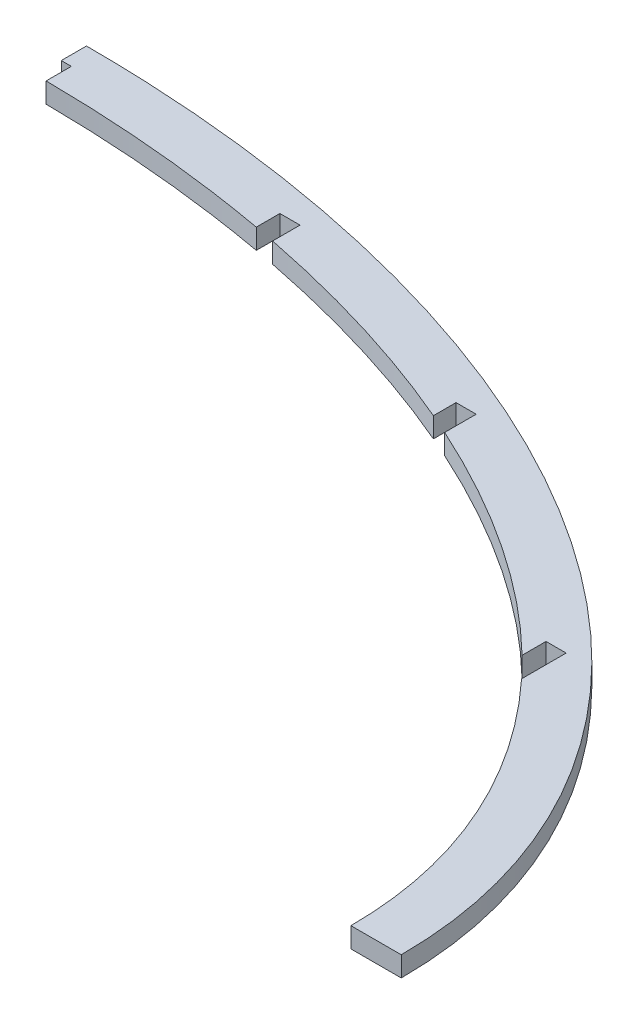
ISO-10303-21;
HEADER;
FILE_DESCRIPTION(('STEP AP214'),'2;1');
FILE_NAME('part.step','',(''),(''),'','','');
FILE_SCHEMA(('AUTOMOTIVE_DESIGN { 1 0 10303 214 1 1 1 1 }'));
ENDSEC;
DATA;
#1=APPLICATION_CONTEXT('core data for automotive mechanical design processes');
#2=APPLICATION_PROTOCOL_DEFINITION('international standard','automotive_design',2000,#1);
#3=PRODUCT_CONTEXT('',#1,'mechanical');
#4=PRODUCT('Part','Part','',(#3));
#5=PRODUCT_RELATED_PRODUCT_CATEGORY('part','',(#4));
#6=PRODUCT_DEFINITION_FORMATION('','',#4);
#7=PRODUCT_DEFINITION_CONTEXT('part definition',#1,'design');
#8=PRODUCT_DEFINITION('design','',#6,#7);
#9=PRODUCT_DEFINITION_SHAPE('','',#8);
#10=(LENGTH_UNIT() NAMED_UNIT(*) SI_UNIT(.MILLI.,.METRE.));
#11=(NAMED_UNIT(*) PLANE_ANGLE_UNIT() SI_UNIT($,.RADIAN.));
#12=(NAMED_UNIT(*) SI_UNIT($,.STERADIAN.) SOLID_ANGLE_UNIT());
#13=UNCERTAINTY_MEASURE_WITH_UNIT(LENGTH_MEASURE(1.E-05),#10,'distance_accuracy_value','');
#14=(GEOMETRIC_REPRESENTATION_CONTEXT(3) GLOBAL_UNCERTAINTY_ASSIGNED_CONTEXT((#13)) GLOBAL_UNIT_ASSIGNED_CONTEXT((#10,
#11,#12)) REPRESENTATION_CONTEXT('',''));
#15=CARTESIAN_POINT('',(0.,0.,0.));
#16=DIRECTION('',(0.,0.,1.));
#17=DIRECTION('',(1.,0.,0.));
#18=AXIS2_PLACEMENT_3D('',#15,#16,#17);
#19=CARTESIAN_POINT('',(-808.,16.,-461.62));
#20=DIRECTION('',(-1.,0.,0.));
#21=DIRECTION('',(0.,0.,1.));
#22=AXIS2_PLACEMENT_3D('',#19,#20,#21);
#23=PLANE('',#22);
#24=DIRECTION('',(0.,0.,-1.));
#25=VECTOR('',#24,1.);
#26=CARTESIAN_POINT('',(-808.,0.,-461.62));
#27=LINE('',#26,#25);
#28=CARTESIAN_POINT('',(-808.,0.,-442.861199088835));
#29=VERTEX_POINT('',#28);
#30=CARTESIAN_POINT('',(-808.,0.,-461.62));
#31=VERTEX_POINT('',#30);
#32=EDGE_CURVE('E198',#29,#31,#27,.T.);
#33=ORIENTED_EDGE('',*,*,#32,.T.);
#34=DIRECTION('',(0.,-1.,0.));
#35=VECTOR('',#34,1.);
#36=CARTESIAN_POINT('',(-808.,16.,-461.62));
#37=LINE('',#36,#35);
#38=CARTESIAN_POINT('',(-808.,16.,-461.62));
#39=VERTEX_POINT('',#38);
#40=EDGE_CURVE('E11',#39,#31,#37,.T.);
#41=ORIENTED_EDGE('',*,*,#40,.F.);
#42=DIRECTION('',(0.,0.,-1.));
#43=VECTOR('',#42,1.);
#44=CARTESIAN_POINT('',(-808.,16.,-461.62));
#45=LINE('',#44,#43);
#46=CARTESIAN_POINT('',(-808.,16.,-442.861199088835));
#47=VERTEX_POINT('',#46);
#48=EDGE_CURVE('E359',#47,#39,#45,.T.);
#49=ORIENTED_EDGE('',*,*,#48,.F.);
#50=DIRECTION('',(0.,-1.,0.));
#51=VECTOR('',#50,1.);
#52=CARTESIAN_POINT('',(-808.,16.,-442.861199088835));
#53=LINE('',#52,#51);
#54=EDGE_CURVE('E193',#47,#29,#53,.T.);
#55=ORIENTED_EDGE('',*,*,#54,.T.);
#56=EDGE_LOOP('',(#33,#41,#49,#55));
#57=FACE_BOUND('',#56,.T.);
#58=ADVANCED_FACE('F41',(#57),#23,.F.);
#59=CARTESIAN_POINT('',(-808.,16.,-461.62));
#60=DIRECTION('',(0.,0.,-1.));
#61=DIRECTION('',(-1.,0.,0.));
#62=AXIS2_PLACEMENT_3D('',#59,#60,#61);
#63=PLANE('',#62);
#64=DIRECTION('',(1.,0.,0.));
#65=VECTOR('',#64,1.);
#66=CARTESIAN_POINT('',(-808.,0.,-461.62));
#67=LINE('',#66,#65);
#68=CARTESIAN_POINT('',(-792.,0.,-461.62));
#69=VERTEX_POINT('',#68);
#70=EDGE_CURVE('E332',#31,#69,#67,.T.);
#71=ORIENTED_EDGE('',*,*,#70,.T.);
#72=DIRECTION('',(0.,-1.,0.));
#73=VECTOR('',#72,1.);
#74=CARTESIAN_POINT('',(-792.,16.,-461.62));
#75=LINE('',#74,#73);
#76=CARTESIAN_POINT('',(-792.,16.,-461.62));
#77=VERTEX_POINT('',#76);
#78=EDGE_CURVE('E49',#77,#69,#75,.T.);
#79=ORIENTED_EDGE('',*,*,#78,.F.);
#80=DIRECTION('',(1.,0.,0.));
#81=VECTOR('',#80,1.);
#82=CARTESIAN_POINT('',(-808.,16.,-461.62));
#83=LINE('',#82,#81);
#84=EDGE_CURVE('E130',#39,#77,#83,.T.);
#85=ORIENTED_EDGE('',*,*,#84,.F.);
#86=ORIENTED_EDGE('',*,*,#40,.T.);
#87=EDGE_LOOP('',(#71,#79,#85,#86));
#88=FACE_BOUND('',#87,.T.);
#89=ADVANCED_FACE('F380',(#88),#63,.F.);
#90=CARTESIAN_POINT('',(-792.,16.,-461.62));
#91=DIRECTION('',(1.,0.,0.));
#92=DIRECTION('',(0.,0.,-1.));
#93=AXIS2_PLACEMENT_3D('',#90,#91,#92);
#94=PLANE('',#93);
#95=DIRECTION('',(0.,0.,1.));
#96=VECTOR('',#95,1.);
#97=CARTESIAN_POINT('',(-792.,0.,-461.62));
#98=LINE('',#97,#96);
#99=CARTESIAN_POINT('',(-792.,0.,-439.817678768634));
#100=VERTEX_POINT('',#99);
#101=EDGE_CURVE('E327',#69,#100,#98,.T.);
#102=ORIENTED_EDGE('',*,*,#101,.T.);
#103=DIRECTION('',(0.,-1.,0.));
#104=VECTOR('',#103,1.);
#105=CARTESIAN_POINT('',(-792.,16.,-439.817678768634));
#106=LINE('',#105,#104);
#107=CARTESIAN_POINT('',(-792.,16.,-439.817678768634));
#108=VERTEX_POINT('',#107);
#109=EDGE_CURVE('E319',#108,#100,#106,.T.);
#110=ORIENTED_EDGE('',*,*,#109,.F.);
#111=DIRECTION('',(0.,0.,1.));
#112=VECTOR('',#111,1.);
#113=CARTESIAN_POINT('',(-792.,16.,-461.62));
#114=LINE('',#113,#112);
#115=EDGE_CURVE('E328',#77,#108,#114,.T.);
#116=ORIENTED_EDGE('',*,*,#115,.F.);
#117=ORIENTED_EDGE('',*,*,#78,.T.);
#118=EDGE_LOOP('',(#102,#110,#116,#117));
#119=FACE_BOUND('',#118,.T.);
#120=ADVANCED_FACE('F325',(#119),#94,.F.);
#121=CARTESIAN_POINT('',(-999.999999999999,16.,0.));
#122=DIRECTION('',(0.,-1.,0.));
#123=DIRECTION('',(1.,0.,0.));
#124=AXIS2_PLACEMENT_3D('',#121,#122,#123);
#125=ELLIPSE('',#124,710.,460.);
#126=DIRECTION('',(0.,-1.,0.));
#127=VECTOR('',#126,1.);
#128=SURFACE_OF_LINEAR_EXTRUSION('',#125,#127);
#129=CARTESIAN_POINT('',(-999.999999999999,0.,0.));
#130=DIRECTION('',(0.,-1.,0.));
#131=DIRECTION('',(1.,0.,0.));
#132=AXIS2_PLACEMENT_3D('',#129,#130,#131);
#133=ELLIPSE('',#132,710.,460.);
#134=CARTESIAN_POINT('',(-608.,0.,-383.53397380892));
#135=VERTEX_POINT('',#134);
#136=EDGE_CURVE('E334',#100,#135,#133,.T.);
#137=ORIENTED_EDGE('',*,*,#136,.T.);
#138=DIRECTION('',(0.,-1.,0.));
#139=VECTOR('',#138,1.);
#140=CARTESIAN_POINT('',(-608.,16.,-383.53397380892));
#141=LINE('',#140,#139);
#142=CARTESIAN_POINT('',(-608.,16.,-383.53397380892));
#143=VERTEX_POINT('',#142);
#144=EDGE_CURVE('E316',#143,#135,#141,.T.);
#145=ORIENTED_EDGE('',*,*,#144,.F.);
#146=EDGE_CURVE('E368',#108,#143,#125,.T.);
#147=ORIENTED_EDGE('',*,*,#146,.F.);
#148=ORIENTED_EDGE('',*,*,#109,.T.);
#149=EDGE_LOOP('',(#137,#145,#147,#148));
#150=FACE_BOUND('',#149,.T.);
#151=ADVANCED_FACE('F373',(#150),#128,.F.);
#152=CARTESIAN_POINT('',(-608.,16.,-401.5));
#153=DIRECTION('',(-1.,0.,0.));
#154=DIRECTION('',(0.,0.,1.));
#155=AXIS2_PLACEMENT_3D('',#152,#153,#154);
#156=PLANE('',#155);
#157=DIRECTION('',(0.,0.,-1.));
#158=VECTOR('',#157,1.);
#159=CARTESIAN_POINT('',(-608.,0.,-401.5));
#160=LINE('',#159,#158);
#161=CARTESIAN_POINT('',(-608.,0.,-401.5));
#162=VERTEX_POINT('',#161);
#163=EDGE_CURVE('E336',#135,#162,#160,.T.);
#164=ORIENTED_EDGE('',*,*,#163,.T.);
#165=DIRECTION('',(0.,-1.,0.));
#166=VECTOR('',#165,1.);
#167=CARTESIAN_POINT('',(-608.,16.,-401.5));
#168=LINE('',#167,#166);
#169=CARTESIAN_POINT('',(-608.,16.,-401.5));
#170=VERTEX_POINT('',#169);
#171=EDGE_CURVE('E313',#170,#162,#168,.T.);
#172=ORIENTED_EDGE('',*,*,#171,.F.);
#173=DIRECTION('',(0.,0.,-1.));
#174=VECTOR('',#173,1.);
#175=CARTESIAN_POINT('',(-608.,16.,-401.5));
#176=LINE('',#175,#174);
#177=EDGE_CURVE('E371',#143,#170,#176,.T.);
#178=ORIENTED_EDGE('',*,*,#177,.F.);
#179=ORIENTED_EDGE('',*,*,#144,.T.);
#180=EDGE_LOOP('',(#164,#172,#178,#179));
#181=FACE_BOUND('',#180,.T.);
#182=ADVANCED_FACE('F377',(#181),#156,.F.);
#183=CARTESIAN_POINT('',(-608.,16.,-401.5));
#184=DIRECTION('',(0.,0.,-1.));
#185=DIRECTION('',(-1.,0.,0.));
#186=AXIS2_PLACEMENT_3D('',#183,#184,#185);
#187=PLANE('',#186);
#188=DIRECTION('',(1.,0.,0.));
#189=VECTOR('',#188,1.);
#190=CARTESIAN_POINT('',(-608.,0.,-401.5));
#191=LINE('',#190,#189);
#192=CARTESIAN_POINT('',(-592.,0.,-401.5));
#193=VERTEX_POINT('',#192);
#194=EDGE_CURVE('E340',#162,#193,#191,.T.);
#195=ORIENTED_EDGE('',*,*,#194,.T.);
#196=DIRECTION('',(0.,-1.,0.));
#197=VECTOR('',#196,1.);
#198=CARTESIAN_POINT('',(-592.,16.,-401.5));
#199=LINE('',#198,#197);
#200=CARTESIAN_POINT('',(-592.,16.,-401.5));
#201=VERTEX_POINT('',#200);
#202=EDGE_CURVE('E310',#201,#193,#199,.T.);
#203=ORIENTED_EDGE('',*,*,#202,.F.);
#204=DIRECTION('',(1.,0.,0.));
#205=VECTOR('',#204,1.);
#206=CARTESIAN_POINT('',(-608.,16.,-401.5));
#207=LINE('',#206,#205);
#208=EDGE_CURVE('E526',#170,#201,#207,.T.);
#209=ORIENTED_EDGE('',*,*,#208,.F.);
#210=ORIENTED_EDGE('',*,*,#171,.T.);
#211=EDGE_LOOP('',(#195,#203,#209,#210));
#212=FACE_BOUND('',#211,.T.);
#213=ADVANCED_FACE('F413',(#212),#187,.F.);
#214=CARTESIAN_POINT('',(-592.,16.,-401.5));
#215=DIRECTION('',(1.,0.,0.));
#216=DIRECTION('',(0.,0.,-1.));
#217=AXIS2_PLACEMENT_3D('',#214,#215,#216);
#218=PLANE('',#217);
#219=DIRECTION('',(0.,0.,1.));
#220=VECTOR('',#219,1.);
#221=CARTESIAN_POINT('',(-592.,0.,-401.5));
#222=LINE('',#221,#220);
#223=CARTESIAN_POINT('',(-592.,0.,-376.464350056838));
#224=VERTEX_POINT('',#223);
#225=EDGE_CURVE('E342',#193,#224,#222,.T.);
#226=ORIENTED_EDGE('',*,*,#225,.T.);
#227=DIRECTION('',(0.,-1.,0.));
#228=VECTOR('',#227,1.);
#229=CARTESIAN_POINT('',(-592.,16.,-376.464350056838));
#230=LINE('',#229,#228);
#231=CARTESIAN_POINT('',(-592.,16.,-376.464350056838));
#232=VERTEX_POINT('',#231);
#233=EDGE_CURVE('E307',#232,#224,#230,.T.);
#234=ORIENTED_EDGE('',*,*,#233,.F.);
#235=DIRECTION('',(0.,0.,1.));
#236=VECTOR('',#235,1.);
#237=CARTESIAN_POINT('',(-592.,16.,-401.5));
#238=LINE('',#237,#236);
#239=EDGE_CURVE('E260',#201,#232,#238,.T.);
#240=ORIENTED_EDGE('',*,*,#239,.F.);
#241=ORIENTED_EDGE('',*,*,#202,.T.);
#242=EDGE_LOOP('',(#226,#234,#240,#241));
#243=FACE_BOUND('',#242,.T.);
#244=ADVANCED_FACE('F252',(#243),#218,.F.);
#245=CARTESIAN_POINT('',(-999.999999999999,16.,0.));
#246=DIRECTION('',(0.,-1.,0.));
#247=DIRECTION('',(1.,0.,0.));
#248=AXIS2_PLACEMENT_3D('',#245,#246,#247);
#249=ELLIPSE('',#248,710.,460.);
#250=DIRECTION('',(0.,-1.,0.));
#251=VECTOR('',#250,1.);
#252=SURFACE_OF_LINEAR_EXTRUSION('',#249,#251);
#253=CARTESIAN_POINT('',(-999.999999999999,0.,0.));
#254=DIRECTION('',(0.,-1.,0.));
#255=DIRECTION('',(1.,0.,0.));
#256=AXIS2_PLACEMENT_3D('',#253,#254,#255);
#257=ELLIPSE('',#256,710.,460.);
#258=CARTESIAN_POINT('',(-408.,0.,-253.948691098757));
#259=VERTEX_POINT('',#258);
#260=EDGE_CURVE('E344',#224,#259,#257,.T.);
#261=ORIENTED_EDGE('',*,*,#260,.T.);
#262=DIRECTION('',(0.,-1.,0.));
#263=VECTOR('',#262,1.);
#264=CARTESIAN_POINT('',(-408.,16.,-253.948691098757));
#265=LINE('',#264,#263);
#266=CARTESIAN_POINT('',(-408.,16.,-253.948691098757));
#267=VERTEX_POINT('',#266);
#268=EDGE_CURVE('E304',#267,#259,#265,.T.);
#269=ORIENTED_EDGE('',*,*,#268,.F.);
#270=EDGE_CURVE('E255',#232,#267,#249,.T.);
#271=ORIENTED_EDGE('',*,*,#270,.F.);
#272=ORIENTED_EDGE('',*,*,#233,.T.);
#273=EDGE_LOOP('',(#261,#269,#271,#272));
#274=FACE_BOUND('',#273,.T.);
#275=ADVANCED_FACE('F247',(#274),#252,.F.);
#276=CARTESIAN_POINT('',(-408.,16.,-272.97));
#277=DIRECTION('',(-1.,0.,0.));
#278=DIRECTION('',(0.,0.,1.));
#279=AXIS2_PLACEMENT_3D('',#276,#277,#278);
#280=PLANE('',#279);
#281=DIRECTION('',(0.,0.,-1.));
#282=VECTOR('',#281,1.);
#283=CARTESIAN_POINT('',(-408.,0.,-272.97));
#284=LINE('',#283,#282);
#285=CARTESIAN_POINT('',(-408.,0.,-272.97));
#286=VERTEX_POINT('',#285);
#287=EDGE_CURVE('E346',#259,#286,#284,.T.);
#288=ORIENTED_EDGE('',*,*,#287,.T.);
#289=DIRECTION('',(0.,-1.,0.));
#290=VECTOR('',#289,1.);
#291=CARTESIAN_POINT('',(-408.,16.,-272.97));
#292=LINE('',#291,#290);
#293=CARTESIAN_POINT('',(-408.,16.,-272.97));
#294=VERTEX_POINT('',#293);
#295=EDGE_CURVE('E301',#294,#286,#292,.T.);
#296=ORIENTED_EDGE('',*,*,#295,.F.);
#297=DIRECTION('',(0.,0.,-1.));
#298=VECTOR('',#297,1.);
#299=CARTESIAN_POINT('',(-408.,16.,-272.97));
#300=LINE('',#299,#298);
#301=EDGE_CURVE('E259',#267,#294,#300,.T.);
#302=ORIENTED_EDGE('',*,*,#301,.F.);
#303=ORIENTED_EDGE('',*,*,#268,.T.);
#304=EDGE_LOOP('',(#288,#296,#302,#303));
#305=FACE_BOUND('',#304,.T.);
#306=ADVANCED_FACE('F243',(#305),#280,.F.);
#307=CARTESIAN_POINT('',(-408.,16.,-272.97));
#308=DIRECTION('',(0.,0.,-1.));
#309=DIRECTION('',(-1.,0.,0.));
#310=AXIS2_PLACEMENT_3D('',#307,#308,#309);
#311=PLANE('',#310);
#312=DIRECTION('',(1.,0.,0.));
#313=VECTOR('',#312,1.);
#314=CARTESIAN_POINT('',(-408.,0.,-272.97));
#315=LINE('',#314,#313);
#316=CARTESIAN_POINT('',(-392.,0.,-272.97));
#317=VERTEX_POINT('',#316);
#318=EDGE_CURVE('E348',#286,#317,#315,.T.);
#319=ORIENTED_EDGE('',*,*,#318,.T.);
#320=DIRECTION('',(0.,-1.,0.));
#321=VECTOR('',#320,1.);
#322=CARTESIAN_POINT('',(-392.,16.,-272.97));
#323=LINE('',#322,#321);
#324=CARTESIAN_POINT('',(-392.,16.,-272.97));
#325=VERTEX_POINT('',#324);
#326=EDGE_CURVE('E275',#325,#317,#323,.T.);
#327=ORIENTED_EDGE('',*,*,#326,.F.);
#328=DIRECTION('',(1.,0.,0.));
#329=VECTOR('',#328,1.);
#330=CARTESIAN_POINT('',(-408.,16.,-272.97));
#331=LINE('',#330,#329);
#332=EDGE_CURVE('E262',#294,#325,#331,.T.);
#333=ORIENTED_EDGE('',*,*,#332,.F.);
#334=ORIENTED_EDGE('',*,*,#295,.T.);
#335=EDGE_LOOP('',(#319,#327,#333,#334));
#336=FACE_BOUND('',#335,.T.);
#337=ADVANCED_FACE('F239',(#336),#311,.F.);
#338=CARTESIAN_POINT('',(-392.,16.,-272.97));
#339=DIRECTION('',(1.,0.,0.));
#340=DIRECTION('',(0.,0.,-1.));
#341=AXIS2_PLACEMENT_3D('',#338,#339,#340);
#342=PLANE('',#341);
#343=DIRECTION('',(0.,0.,1.));
#344=VECTOR('',#343,1.);
#345=CARTESIAN_POINT('',(-392.,0.,-272.97));
#346=LINE('',#345,#344);
#347=CARTESIAN_POINT('',(-392.,0.,-237.551224808157));
#348=VERTEX_POINT('',#347);
#349=EDGE_CURVE('E273',#317,#348,#346,.T.);
#350=ORIENTED_EDGE('',*,*,#349,.T.);
#351=DIRECTION('',(0.,-1.,0.));
#352=VECTOR('',#351,1.);
#353=CARTESIAN_POINT('',(-392.,16.,-237.551224808157));
#354=LINE('',#353,#352);
#355=CARTESIAN_POINT('',(-392.,16.,-237.551224808157));
#356=VERTEX_POINT('',#355);
#357=EDGE_CURVE('E271',#356,#348,#354,.T.);
#358=ORIENTED_EDGE('',*,*,#357,.F.);
#359=DIRECTION('',(0.,0.,1.));
#360=VECTOR('',#359,1.);
#361=CARTESIAN_POINT('',(-392.,16.,-272.97));
#362=LINE('',#361,#360);
#363=EDGE_CURVE('E230',#325,#356,#362,.T.);
#364=ORIENTED_EDGE('',*,*,#363,.F.);
#365=ORIENTED_EDGE('',*,*,#326,.T.);
#366=EDGE_LOOP('',(#350,#358,#364,#365));
#367=FACE_BOUND('',#366,.T.);
#368=ADVANCED_FACE('F235',(#367),#342,.F.);
#369=CARTESIAN_POINT('',(-999.999999999999,16.,0.));
#370=DIRECTION('',(0.,-1.,0.));
#371=DIRECTION('',(1.,0.,0.));
#372=AXIS2_PLACEMENT_3D('',#369,#370,#371);
#373=ELLIPSE('',#372,710.,460.);
#374=DIRECTION('',(0.,-1.,0.));
#375=VECTOR('',#374,1.);
#376=SURFACE_OF_LINEAR_EXTRUSION('',#373,#375);
#377=CARTESIAN_POINT('',(-999.999999999999,0.,0.));
#378=DIRECTION('',(0.,-1.,0.));
#379=DIRECTION('',(1.,0.,0.));
#380=AXIS2_PLACEMENT_3D('',#377,#378,#379);
#381=ELLIPSE('',#380,710.,460.);
#382=CARTESIAN_POINT('',(-289.999999999999,0.,0.));
#383=VERTEX_POINT('',#382);
#384=EDGE_CURVE('E280',#348,#383,#381,.T.);
#385=ORIENTED_EDGE('',*,*,#384,.T.);
#386=DIRECTION('',(0.,-1.,0.));
#387=VECTOR('',#386,1.);
#388=CARTESIAN_POINT('',(-289.999999999999,16.,0.));
#389=LINE('',#388,#387);
#390=CARTESIAN_POINT('',(-289.999999999999,16.,0.));
#391=VERTEX_POINT('',#390);
#392=EDGE_CURVE('E276',#391,#383,#389,.T.);
#393=ORIENTED_EDGE('',*,*,#392,.F.);
#394=EDGE_CURVE('E227',#356,#391,#373,.T.);
#395=ORIENTED_EDGE('',*,*,#394,.F.);
#396=ORIENTED_EDGE('',*,*,#357,.T.);
#397=EDGE_LOOP('',(#385,#393,#395,#396));
#398=FACE_BOUND('',#397,.T.);
#399=ADVANCED_FACE('F232',(#398),#376,.F.);
#400=CARTESIAN_POINT('',(-289.999999999999,16.,0.));
#401=DIRECTION('',(0.,0.,-1.));
#402=DIRECTION('',(-1.,0.,0.));
#403=AXIS2_PLACEMENT_3D('',#400,#401,#402);
#404=PLANE('',#403);
#405=DIRECTION('',(1.,0.,0.));
#406=VECTOR('',#405,1.);
#407=CARTESIAN_POINT('',(-289.999999999999,0.,0.));
#408=LINE('',#407,#406);
#409=CARTESIAN_POINT('',(-250.,0.,-1.66533453693773E-13));
#410=VERTEX_POINT('',#409);
#411=EDGE_CURVE('E352',#383,#410,#408,.T.);
#412=ORIENTED_EDGE('',*,*,#411,.T.);
#413=DIRECTION('',(0.,-1.,0.));
#414=VECTOR('',#413,1.);
#415=CARTESIAN_POINT('',(-250.,16.,-1.66533453693773E-13));
#416=LINE('',#415,#414);
#417=CARTESIAN_POINT('',(-250.,16.,-1.66533453693773E-13));
#418=VERTEX_POINT('',#417);
#419=EDGE_CURVE('E283',#418,#410,#416,.T.);
#420=ORIENTED_EDGE('',*,*,#419,.F.);
#421=DIRECTION('',(1.,0.,0.));
#422=VECTOR('',#421,1.);
#423=CARTESIAN_POINT('',(-289.999999999999,16.,0.));
#424=LINE('',#423,#422);
#425=EDGE_CURVE('E225',#391,#418,#424,.T.);
#426=ORIENTED_EDGE('',*,*,#425,.F.);
#427=ORIENTED_EDGE('',*,*,#392,.T.);
#428=EDGE_LOOP('',(#412,#420,#426,#427));
#429=FACE_BOUND('',#428,.T.);
#430=ADVANCED_FACE('F219',(#429),#404,.F.);
#431=CARTESIAN_POINT('',(-999.999999999999,16.,0.));
#432=DIRECTION('',(0.,1.,0.));
#433=DIRECTION('',(1.,0.,0.));
#434=AXIS2_PLACEMENT_3D('',#431,#432,#433);
#435=ELLIPSE('',#434,749.999999999999,500.);
#436=DIRECTION('',(0.,-1.,0.));
#437=VECTOR('',#436,1.);
#438=SURFACE_OF_LINEAR_EXTRUSION('',#435,#437);
#439=CARTESIAN_POINT('',(-999.999999999999,0.,0.));
#440=DIRECTION('',(0.,1.,0.));
#441=DIRECTION('',(1.,0.,0.));
#442=AXIS2_PLACEMENT_3D('',#439,#440,#441);
#443=ELLIPSE('',#442,749.999999999999,500.);
#444=CARTESIAN_POINT('',(-1000.,0.,-500.));
#445=VERTEX_POINT('',#444);
#446=EDGE_CURVE('E292',#410,#445,#443,.T.);
#447=ORIENTED_EDGE('',*,*,#446,.T.);
#448=DIRECTION('',(0.,-1.,0.));
#449=VECTOR('',#448,1.);
#450=CARTESIAN_POINT('',(-1000.,16.,-500.));
#451=LINE('',#450,#449);
#452=CARTESIAN_POINT('',(-1000.,16.,-500.));
#453=VERTEX_POINT('',#452);
#454=EDGE_CURVE('E290',#453,#445,#451,.T.);
#455=ORIENTED_EDGE('',*,*,#454,.F.);
#456=EDGE_CURVE('E222',#418,#453,#435,.T.);
#457=ORIENTED_EDGE('',*,*,#456,.F.);
#458=ORIENTED_EDGE('',*,*,#419,.T.);
#459=EDGE_LOOP('',(#447,#455,#457,#458));
#460=FACE_BOUND('',#459,.T.);
#461=ADVANCED_FACE('F214',(#460),#438,.F.);
#462=CARTESIAN_POINT('',(-999.999999999999,16.,-500.));
#463=DIRECTION('',(1.,0.,0.));
#464=DIRECTION('',(0.,0.,-1.));
#465=AXIS2_PLACEMENT_3D('',#462,#463,#464);
#466=PLANE('',#465);
#467=DIRECTION('',(0.,0.,1.));
#468=VECTOR('',#467,1.);
#469=CARTESIAN_POINT('',(-999.999999999999,0.,-500.));
#470=LINE('',#469,#468);
#471=CARTESIAN_POINT('',(-999.999999999999,0.,-480.));
#472=VERTEX_POINT('',#471);
#473=EDGE_CURVE('E295',#445,#472,#470,.T.);
#474=ORIENTED_EDGE('',*,*,#473,.T.);
#475=DIRECTION('',(0.,-1.,0.));
#476=VECTOR('',#475,1.);
#477=CARTESIAN_POINT('',(-999.999999999999,16.,-480.));
#478=LINE('',#477,#476);
#479=CARTESIAN_POINT('',(-999.999999999999,16.,-480.));
#480=VERTEX_POINT('',#479);
#481=EDGE_CURVE('E188',#480,#472,#478,.T.);
#482=ORIENTED_EDGE('',*,*,#481,.F.);
#483=DIRECTION('',(0.,0.,1.));
#484=VECTOR('',#483,1.);
#485=CARTESIAN_POINT('',(-999.999999999999,16.,-500.));
#486=LINE('',#485,#484);
#487=EDGE_CURVE('E179',#453,#480,#486,.T.);
#488=ORIENTED_EDGE('',*,*,#487,.F.);
#489=ORIENTED_EDGE('',*,*,#454,.T.);
#490=EDGE_LOOP('',(#474,#482,#488,#489));
#491=FACE_BOUND('',#490,.T.);
#492=ADVANCED_FACE('F211',(#491),#466,.F.);
#493=CARTESIAN_POINT('',(-999.999999999999,16.,-480.));
#494=DIRECTION('',(0.,0.,-1.));
#495=DIRECTION('',(-1.,0.,0.));
#496=AXIS2_PLACEMENT_3D('',#493,#494,#495);
#497=PLANE('',#496);
#498=DIRECTION('',(1.,0.,0.));
#499=VECTOR('',#498,1.);
#500=CARTESIAN_POINT('',(-999.999999999999,0.,-480.));
#501=LINE('',#500,#499);
#502=CARTESIAN_POINT('',(-992.,0.,-480.));
#503=VERTEX_POINT('',#502);
#504=EDGE_CURVE('E187',#472,#503,#501,.T.);
#505=ORIENTED_EDGE('',*,*,#504,.T.);
#506=DIRECTION('',(0.,-1.,0.));
#507=VECTOR('',#506,1.);
#508=CARTESIAN_POINT('',(-992.,16.,-480.));
#509=LINE('',#508,#507);
#510=CARTESIAN_POINT('',(-992.,16.,-480.));
#511=VERTEX_POINT('',#510);
#512=EDGE_CURVE('E184',#511,#503,#509,.T.);
#513=ORIENTED_EDGE('',*,*,#512,.F.);
#514=DIRECTION('',(1.,0.,0.));
#515=VECTOR('',#514,1.);
#516=CARTESIAN_POINT('',(-999.999999999999,16.,-480.));
#517=LINE('',#516,#515);
#518=EDGE_CURVE('E173',#480,#511,#517,.T.);
#519=ORIENTED_EDGE('',*,*,#518,.F.);
#520=ORIENTED_EDGE('',*,*,#481,.T.);
#521=EDGE_LOOP('',(#505,#513,#519,#520));
#522=FACE_BOUND('',#521,.T.);
#523=ADVANCED_FACE('F185',(#522),#497,.F.);
#524=CARTESIAN_POINT('',(-992.,16.,-480.));
#525=DIRECTION('',(1.,0.,0.));
#526=DIRECTION('',(0.,0.,-1.));
#527=AXIS2_PLACEMENT_3D('',#524,#525,#526);
#528=PLANE('',#527);
#529=DIRECTION('',(0.,0.,1.));
#530=VECTOR('',#529,1.);
#531=CARTESIAN_POINT('',(-992.,0.,-480.));
#532=LINE('',#531,#530);
#533=CARTESIAN_POINT('',(-992.,0.,-459.970798517678));
#534=VERTEX_POINT('',#533);
#535=EDGE_CURVE('E116',#503,#534,#532,.T.);
#536=ORIENTED_EDGE('',*,*,#535,.T.);
#537=DIRECTION('',(0.,-1.,0.));
#538=VECTOR('',#537,1.);
#539=CARTESIAN_POINT('',(-992.,16.,-459.970798517678));
#540=LINE('',#539,#538);
#541=CARTESIAN_POINT('',(-992.,16.,-459.970798517678));
#542=VERTEX_POINT('',#541);
#543=EDGE_CURVE('E189',#542,#534,#540,.T.);
#544=ORIENTED_EDGE('',*,*,#543,.F.);
#545=DIRECTION('',(0.,0.,1.));
#546=VECTOR('',#545,1.);
#547=CARTESIAN_POINT('',(-992.,16.,-480.));
#548=LINE('',#547,#546);
#549=EDGE_CURVE('E177',#511,#542,#548,.T.);
#550=ORIENTED_EDGE('',*,*,#549,.F.);
#551=ORIENTED_EDGE('',*,*,#512,.T.);
#552=EDGE_LOOP('',(#536,#544,#550,#551));
#553=FACE_BOUND('',#552,.T.);
#554=ADVANCED_FACE('F191',(#553),#528,.F.);
#555=CARTESIAN_POINT('',(-999.999999999999,16.,0.));
#556=DIRECTION('',(0.,-1.,0.));
#557=DIRECTION('',(1.,0.,0.));
#558=AXIS2_PLACEMENT_3D('',#555,#556,#557);
#559=ELLIPSE('',#558,710.,460.);
#560=DIRECTION('',(0.,-1.,0.));
#561=VECTOR('',#560,1.);
#562=SURFACE_OF_LINEAR_EXTRUSION('',#559,#561);
#563=CARTESIAN_POINT('',(-999.999999999999,0.,0.));
#564=DIRECTION('',(0.,-1.,0.));
#565=DIRECTION('',(1.,0.,0.));
#566=AXIS2_PLACEMENT_3D('',#563,#564,#565);
#567=ELLIPSE('',#566,710.,460.);
#568=EDGE_CURVE('E122',#534,#29,#567,.T.);
#569=ORIENTED_EDGE('',*,*,#568,.T.);
#570=ORIENTED_EDGE('',*,*,#54,.F.);
#571=EDGE_CURVE('E57',#542,#47,#559,.T.);
#572=ORIENTED_EDGE('',*,*,#571,.F.);
#573=ORIENTED_EDGE('',*,*,#543,.T.);
#574=EDGE_LOOP('',(#569,#570,#572,#573));
#575=FACE_BOUND('',#574,.T.);
#576=ADVANCED_FACE('F201',(#575),#562,.F.);
#577=CARTESIAN_POINT('',(-999.999999999999,16.,0.));
#578=DIRECTION('',(0.,1.,0.));
#579=DIRECTION('',(0.,0.,1.));
#580=AXIS2_PLACEMENT_3D('',#577,#578,#579);
#581=PLANE('',#580);
#582=ORIENTED_EDGE('',*,*,#48,.T.);
#583=ORIENTED_EDGE('',*,*,#84,.T.);
#584=ORIENTED_EDGE('',*,*,#115,.T.);
#585=ORIENTED_EDGE('',*,*,#146,.T.);
#586=ORIENTED_EDGE('',*,*,#177,.T.);
#587=ORIENTED_EDGE('',*,*,#208,.T.);
#588=ORIENTED_EDGE('',*,*,#239,.T.);
#589=ORIENTED_EDGE('',*,*,#270,.T.);
#590=ORIENTED_EDGE('',*,*,#301,.T.);
#591=ORIENTED_EDGE('',*,*,#332,.T.);
#592=ORIENTED_EDGE('',*,*,#363,.T.);
#593=ORIENTED_EDGE('',*,*,#394,.T.);
#594=ORIENTED_EDGE('',*,*,#425,.T.);
#595=ORIENTED_EDGE('',*,*,#456,.T.);
#596=ORIENTED_EDGE('',*,*,#487,.T.);
#597=ORIENTED_EDGE('',*,*,#518,.T.);
#598=ORIENTED_EDGE('',*,*,#549,.T.);
#599=ORIENTED_EDGE('',*,*,#571,.T.);
#600=EDGE_LOOP('',(#582,#583,#584,#585,#586,#587,#588,#589,#590,#591,#592,#593,#594,#595,#596,
#597,#598,#599));
#601=FACE_BOUND('',#600,.T.);
#602=ADVANCED_FACE('F175',(#601),#581,.T.);
#603=CARTESIAN_POINT('',(-999.999999999999,0.,0.));
#604=DIRECTION('',(0.,1.,0.));
#605=DIRECTION('',(0.,0.,1.));
#606=AXIS2_PLACEMENT_3D('',#603,#604,#605);
#607=PLANE('',#606);
#608=ORIENTED_EDGE('',*,*,#32,.F.);
#609=ORIENTED_EDGE('',*,*,#568,.F.);
#610=ORIENTED_EDGE('',*,*,#535,.F.);
#611=ORIENTED_EDGE('',*,*,#504,.F.);
#612=ORIENTED_EDGE('',*,*,#473,.F.);
#613=ORIENTED_EDGE('',*,*,#446,.F.);
#614=ORIENTED_EDGE('',*,*,#411,.F.);
#615=ORIENTED_EDGE('',*,*,#384,.F.);
#616=ORIENTED_EDGE('',*,*,#349,.F.);
#617=ORIENTED_EDGE('',*,*,#318,.F.);
#618=ORIENTED_EDGE('',*,*,#287,.F.);
#619=ORIENTED_EDGE('',*,*,#260,.F.);
#620=ORIENTED_EDGE('',*,*,#225,.F.);
#621=ORIENTED_EDGE('',*,*,#194,.F.);
#622=ORIENTED_EDGE('',*,*,#163,.F.);
#623=ORIENTED_EDGE('',*,*,#136,.F.);
#624=ORIENTED_EDGE('',*,*,#101,.F.);
#625=ORIENTED_EDGE('',*,*,#70,.F.);
#626=EDGE_LOOP('',(#608,#609,#610,#611,#612,#613,#614,#615,#616,#617,#618,#619,#620,#621,#622,
#623,#624,#625));
#627=FACE_BOUND('',#626,.T.);
#628=ADVANCED_FACE('F205',(#627),#607,.F.);
#629=CLOSED_SHELL('',(#58,#89,#120,#151,#182,#213,#244,#275,#306,#337,#368,#399,#430,#461,#492,
#523,#554,#576,#602,#628));
#630=MANIFOLD_SOLID_BREP('B2',#629);
#631=ADVANCED_BREP_SHAPE_REPRESENTATION('',(#18,#630),#14);
#632=SHAPE_DEFINITION_REPRESENTATION(#9,#631);
ENDSEC;
END-ISO-10303-21;
